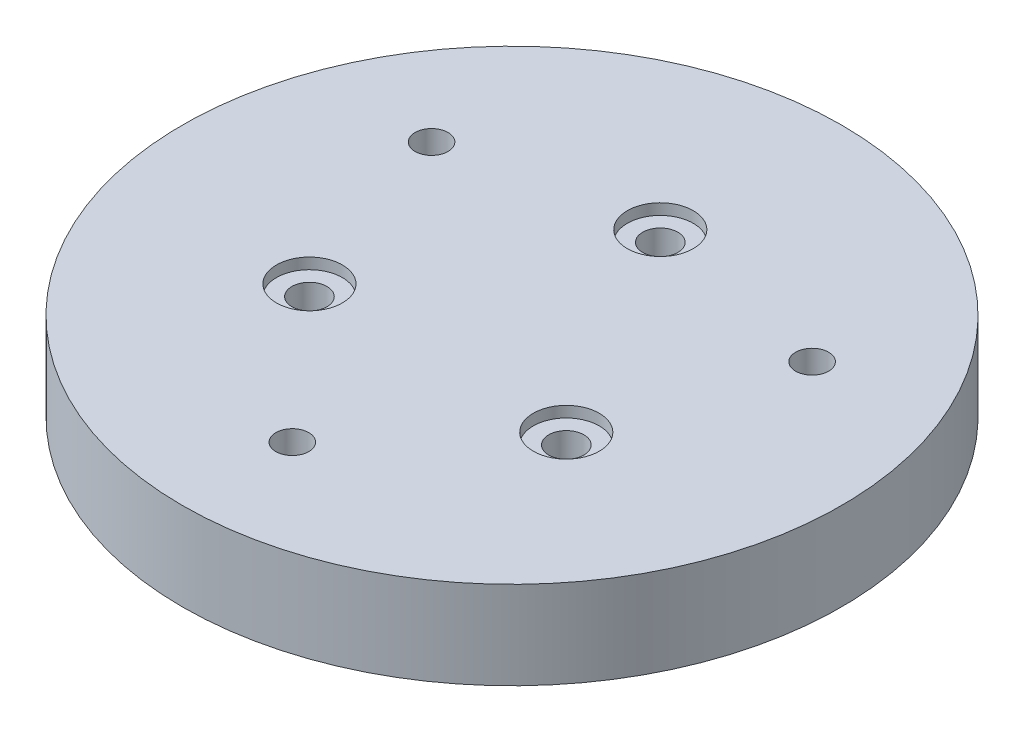
ISO-10303-21;
HEADER;
FILE_DESCRIPTION(('STEP AP214'),'2;1');
FILE_NAME('part.step','',(''),(''),'','','');
FILE_SCHEMA(('AUTOMOTIVE_DESIGN { 1 0 10303 214 1 1 1 1 }'));
ENDSEC;
DATA;
#1=APPLICATION_CONTEXT('core data for automotive mechanical design processes');
#2=APPLICATION_PROTOCOL_DEFINITION('international standard','automotive_design',2000,#1);
#3=PRODUCT_CONTEXT('',#1,'mechanical');
#4=PRODUCT('Part','Part','',(#3));
#5=PRODUCT_RELATED_PRODUCT_CATEGORY('part','',(#4));
#6=PRODUCT_DEFINITION_FORMATION('','',#4);
#7=PRODUCT_DEFINITION_CONTEXT('part definition',#1,'design');
#8=PRODUCT_DEFINITION('design','',#6,#7);
#9=PRODUCT_DEFINITION_SHAPE('','',#8);
#10=(LENGTH_UNIT() NAMED_UNIT(*) SI_UNIT(.MILLI.,.METRE.));
#11=(NAMED_UNIT(*) PLANE_ANGLE_UNIT() SI_UNIT($,.RADIAN.));
#12=(NAMED_UNIT(*) SI_UNIT($,.STERADIAN.) SOLID_ANGLE_UNIT());
#13=UNCERTAINTY_MEASURE_WITH_UNIT(LENGTH_MEASURE(1.E-05),#10,'distance_accuracy_value','');
#14=(GEOMETRIC_REPRESENTATION_CONTEXT(3) GLOBAL_UNCERTAINTY_ASSIGNED_CONTEXT((#13)) GLOBAL_UNIT_ASSIGNED_CONTEXT((#10,
#11,#12)) REPRESENTATION_CONTEXT('',''));
#15=CARTESIAN_POINT('',(0.,0.,0.));
#16=DIRECTION('',(0.,0.,1.));
#17=DIRECTION('',(1.,0.,0.));
#18=AXIS2_PLACEMENT_3D('',#15,#16,#17);
#19=CARTESIAN_POINT('',(1.32093313736707E-12,0.,19.9999999999993));
#20=DIRECTION('',(0.,1.,0.));
#21=DIRECTION('',(0.,0.,1.));
#22=AXIS2_PLACEMENT_3D('',#19,#20,#21);
#23=CYLINDRICAL_SURFACE('',#22,1.50000000000161);
#24=CARTESIAN_POINT('',(1.32093313736707E-12,8.,19.9999999999993));
#25=DIRECTION('',(0.,1.,0.));
#26=DIRECTION('',(0.,0.,1.));
#27=AXIS2_PLACEMENT_3D('',#24,#25,#26);
#28=CIRCLE('',#27,1.50000000000161);
#29=CARTESIAN_POINT('',(1.32093313736707E-12,8.,21.5000000000009));
#30=VERTEX_POINT('',#29);
#31=EDGE_CURVE('E342',#30,#30,#28,.T.);
#32=ORIENTED_EDGE('',*,*,#31,.T.);
#33=EDGE_LOOP('',(#32));
#34=FACE_BOUND('',#33,.T.);
#35=CARTESIAN_POINT('',(1.32093313736707E-12,4.,19.9999999999993));
#36=DIRECTION('',(0.,-1.,0.));
#37=DIRECTION('',(0.,0.,-1.));
#38=AXIS2_PLACEMENT_3D('',#35,#36,#37);
#39=CIRCLE('',#38,1.50000000000161);
#40=CARTESIAN_POINT('',(1.32093313736707E-12,4.,18.4999999999977));
#41=VERTEX_POINT('',#40);
#42=EDGE_CURVE('E39',#41,#41,#39,.F.);
#43=ORIENTED_EDGE('',*,*,#42,.F.);
#44=EDGE_LOOP('',(#43));
#45=FACE_BOUND('',#44,.T.);
#46=ADVANCED_FACE('F35',(#34,#45),#23,.F.);
#47=CARTESIAN_POINT('',(-17.3205080756875,0.,-9.99999999999923));
#48=DIRECTION('',(0.,1.,0.));
#49=DIRECTION('',(0.,0.,1.));
#50=AXIS2_PLACEMENT_3D('',#47,#48,#49);
#51=CYLINDRICAL_SURFACE('',#50,1.50000000000161);
#52=CARTESIAN_POINT('',(-17.3205080756875,8.,-9.99999999999923));
#53=DIRECTION('',(0.,1.,0.));
#54=DIRECTION('',(0.,0.,1.));
#55=AXIS2_PLACEMENT_3D('',#52,#53,#54);
#56=CIRCLE('',#55,1.50000000000161);
#57=CARTESIAN_POINT('',(-17.3205080756875,8.,-8.49999999999762));
#58=VERTEX_POINT('',#57);
#59=EDGE_CURVE('E339',#58,#58,#56,.T.);
#60=ORIENTED_EDGE('',*,*,#59,.T.);
#61=EDGE_LOOP('',(#60));
#62=FACE_BOUND('',#61,.T.);
#63=CARTESIAN_POINT('',(-17.3205080756875,4.,-9.99999999999923));
#64=DIRECTION('',(0.,-1.,0.));
#65=DIRECTION('',(0.,0.,-1.));
#66=AXIS2_PLACEMENT_3D('',#63,#64,#65);
#67=CIRCLE('',#66,1.50000000000161);
#68=CARTESIAN_POINT('',(-17.3205080756875,4.,-11.5000000000008));
#69=VERTEX_POINT('',#68);
#70=EDGE_CURVE('E183',#69,#69,#67,.F.);
#71=ORIENTED_EDGE('',*,*,#70,.F.);
#72=EDGE_LOOP('',(#71));
#73=FACE_BOUND('',#72,.T.);
#74=ADVANCED_FACE('F379',(#62,#73),#51,.F.);
#75=CARTESIAN_POINT('',(17.3205080756888,0.,-10.));
#76=DIRECTION('',(0.,1.,0.));
#77=DIRECTION('',(0.,0.,1.));
#78=AXIS2_PLACEMENT_3D('',#75,#76,#77);
#79=CYLINDRICAL_SURFACE('',#78,1.50000000000162);
#80=CARTESIAN_POINT('',(17.3205080756888,8.,-10.));
#81=DIRECTION('',(0.,1.,0.));
#82=DIRECTION('',(0.,0.,1.));
#83=AXIS2_PLACEMENT_3D('',#80,#81,#82);
#84=CIRCLE('',#83,1.50000000000162);
#85=CARTESIAN_POINT('',(17.3205080756888,8.,-8.49999999999841));
#86=VERTEX_POINT('',#85);
#87=EDGE_CURVE('E335',#86,#86,#84,.T.);
#88=ORIENTED_EDGE('',*,*,#87,.T.);
#89=EDGE_LOOP('',(#88));
#90=FACE_BOUND('',#89,.T.);
#91=CARTESIAN_POINT('',(17.3205080756888,4.,-10.));
#92=DIRECTION('',(0.,-1.,0.));
#93=DIRECTION('',(0.,0.,-1.));
#94=AXIS2_PLACEMENT_3D('',#91,#92,#93);
#95=CIRCLE('',#94,1.50000000000162);
#96=CARTESIAN_POINT('',(17.3205080756888,4.,-11.5000000000016));
#97=VERTEX_POINT('',#96);
#98=EDGE_CURVE('E237',#97,#97,#95,.F.);
#99=ORIENTED_EDGE('',*,*,#98,.F.);
#100=EDGE_LOOP('',(#99));
#101=FACE_BOUND('',#100,.T.);
#102=ADVANCED_FACE('F368',(#90,#101),#79,.F.);
#103=CARTESIAN_POINT('',(11.6913429510908,-7.,6.74999999999949));
#104=DIRECTION('',(0.,1.,0.));
#105=DIRECTION('',(0.,0.,1.));
#106=AXIS2_PLACEMENT_3D('',#103,#104,#105);
#107=CYLINDRICAL_SURFACE('',#106,1.60000000000075);
#108=CARTESIAN_POINT('',(11.6913429510908,0.,6.74999999999949));
#109=DIRECTION('',(0.,1.,0.));
#110=DIRECTION('',(0.,0.,1.));
#111=AXIS2_PLACEMENT_3D('',#108,#109,#110);
#112=CIRCLE('',#111,1.60000000000075);
#113=CARTESIAN_POINT('',(11.6913429510908,0.,8.35000000000024));
#114=VERTEX_POINT('',#113);
#115=EDGE_CURVE('E338',#114,#114,#112,.T.);
#116=ORIENTED_EDGE('',*,*,#115,.F.);
#117=EDGE_LOOP('',(#116));
#118=FACE_BOUND('',#117,.T.);
#119=CARTESIAN_POINT('',(11.6913429510908,7.,6.74999999999949));
#120=DIRECTION('',(0.,1.,0.));
#121=DIRECTION('',(0.,0.,1.));
#122=AXIS2_PLACEMENT_3D('',#119,#120,#121);
#123=CIRCLE('',#122,1.60000000000075);
#124=CARTESIAN_POINT('',(11.6913429510908,7.,8.35000000000024));
#125=VERTEX_POINT('',#124);
#126=EDGE_CURVE('E344',#125,#125,#123,.F.);
#127=ORIENTED_EDGE('',*,*,#126,.F.);
#128=EDGE_LOOP('',(#127));
#129=FACE_BOUND('',#128,.T.);
#130=ADVANCED_FACE('F365',(#118,#129),#107,.F.);
#131=CARTESIAN_POINT('',(-11.6913429510891,-7.,6.7500000000005));
#132=DIRECTION('',(0.,1.,0.));
#133=DIRECTION('',(0.,0.,1.));
#134=AXIS2_PLACEMENT_3D('',#131,#132,#133);
#135=CYLINDRICAL_SURFACE('',#134,1.60000000000109);
#136=CARTESIAN_POINT('',(-11.6913429510891,0.,6.7500000000005));
#137=DIRECTION('',(0.,1.,0.));
#138=DIRECTION('',(0.,0.,1.));
#139=AXIS2_PLACEMENT_3D('',#136,#137,#138);
#140=CIRCLE('',#139,1.60000000000109);
#141=CARTESIAN_POINT('',(-11.6913429510891,0.,8.35000000000159));
#142=VERTEX_POINT('',#141);
#143=EDGE_CURVE('E351',#142,#142,#140,.T.);
#144=ORIENTED_EDGE('',*,*,#143,.F.);
#145=EDGE_LOOP('',(#144));
#146=FACE_BOUND('',#145,.T.);
#147=CARTESIAN_POINT('',(-11.6913429510891,7.,6.7500000000005));
#148=DIRECTION('',(0.,1.,0.));
#149=DIRECTION('',(0.,0.,1.));
#150=AXIS2_PLACEMENT_3D('',#147,#148,#149);
#151=CIRCLE('',#150,1.60000000000109);
#152=CARTESIAN_POINT('',(-11.6913429510891,7.,8.35000000000159));
#153=VERTEX_POINT('',#152);
#154=EDGE_CURVE('E358',#153,#153,#151,.F.);
#155=ORIENTED_EDGE('',*,*,#154,.F.);
#156=EDGE_LOOP('',(#155));
#157=FACE_BOUND('',#156,.T.);
#158=ADVANCED_FACE('F367',(#146,#157),#135,.F.);
#159=CARTESIAN_POINT('',(0.,-7.,-13.5));
#160=DIRECTION('',(0.,1.,0.));
#161=DIRECTION('',(0.,0.,1.));
#162=AXIS2_PLACEMENT_3D('',#159,#160,#161);
#163=CYLINDRICAL_SURFACE('',#162,1.6);
#164=CARTESIAN_POINT('',(0.,0.,-13.5));
#165=DIRECTION('',(0.,1.,0.));
#166=DIRECTION('',(0.,0.,1.));
#167=AXIS2_PLACEMENT_3D('',#164,#165,#166);
#168=CIRCLE('',#167,1.6);
#169=CARTESIAN_POINT('',(0.,0.,-11.9));
#170=VERTEX_POINT('',#169);
#171=EDGE_CURVE('E348',#170,#170,#168,.T.);
#172=ORIENTED_EDGE('',*,*,#171,.F.);
#173=EDGE_LOOP('',(#172));
#174=FACE_BOUND('',#173,.T.);
#175=CARTESIAN_POINT('',(0.,7.,-13.5));
#176=DIRECTION('',(0.,1.,0.));
#177=DIRECTION('',(0.,0.,1.));
#178=AXIS2_PLACEMENT_3D('',#175,#176,#177);
#179=CIRCLE('',#178,1.6);
#180=CARTESIAN_POINT('',(0.,7.,-11.9));
#181=VERTEX_POINT('',#180);
#182=EDGE_CURVE('E319',#181,#181,#179,.F.);
#183=ORIENTED_EDGE('',*,*,#182,.F.);
#184=EDGE_LOOP('',(#183));
#185=FACE_BOUND('',#184,.T.);
#186=ADVANCED_FACE('F375',(#174,#185),#163,.F.);
#187=CARTESIAN_POINT('',(0.,8.,0.));
#188=DIRECTION('',(0.,-1.,0.));
#189=DIRECTION('',(0.,0.,-1.));
#190=AXIS2_PLACEMENT_3D('',#187,#188,#189);
#191=CYLINDRICAL_SURFACE('',#190,30.);
#192=CARTESIAN_POINT('',(0.,8.,0.));
#193=DIRECTION('',(0.,1.,0.));
#194=DIRECTION('',(0.,0.,1.));
#195=AXIS2_PLACEMENT_3D('',#192,#193,#194);
#196=CIRCLE('',#195,30.);
#197=CARTESIAN_POINT('',(0.,8.,30.));
#198=VERTEX_POINT('',#197);
#199=EDGE_CURVE('E11',#198,#198,#196,.T.);
#200=ORIENTED_EDGE('',*,*,#199,.F.);
#201=EDGE_LOOP('',(#200));
#202=FACE_BOUND('',#201,.T.);
#203=CARTESIAN_POINT('',(0.,0.,0.));
#204=DIRECTION('',(0.,1.,0.));
#205=DIRECTION('',(0.,0.,1.));
#206=AXIS2_PLACEMENT_3D('',#203,#204,#205);
#207=CIRCLE('',#206,30.);
#208=CARTESIAN_POINT('',(0.,0.,30.));
#209=VERTEX_POINT('',#208);
#210=EDGE_CURVE('E44',#209,#209,#207,.T.);
#211=ORIENTED_EDGE('',*,*,#210,.T.);
#212=EDGE_LOOP('',(#211));
#213=FACE_BOUND('',#212,.T.);
#214=ADVANCED_FACE('F37',(#202,#213),#191,.T.);
#215=CARTESIAN_POINT('',(0.,8.,0.));
#216=DIRECTION('',(0.,1.,0.));
#217=DIRECTION('',(0.,0.,1.));
#218=AXIS2_PLACEMENT_3D('',#215,#216,#217);
#219=PLANE('',#218);
#220=CARTESIAN_POINT('',(0.,8.,-13.5));
#221=DIRECTION('',(0.,1.,0.));
#222=DIRECTION('',(0.,0.,1.));
#223=AXIS2_PLACEMENT_3D('',#220,#221,#222);
#224=CIRCLE('',#223,3.);
#225=CARTESIAN_POINT('',(0.,8.,-10.5));
#226=VERTEX_POINT('',#225);
#227=EDGE_CURVE('E320',#226,#226,#224,.T.);
#228=ORIENTED_EDGE('',*,*,#227,.F.);
#229=EDGE_LOOP('',(#228));
#230=FACE_BOUND('',#229,.T.);
#231=CARTESIAN_POINT('',(11.6913429510908,8.,6.74999999999949));
#232=DIRECTION('',(0.,1.,0.));
#233=DIRECTION('',(0.,0.,1.));
#234=AXIS2_PLACEMENT_3D('',#231,#232,#233);
#235=CIRCLE('',#234,3.00000000000075);
#236=CARTESIAN_POINT('',(11.6913429510908,8.,9.75000000000024));
#237=VERTEX_POINT('',#236);
#238=EDGE_CURVE('E326',#237,#237,#235,.T.);
#239=ORIENTED_EDGE('',*,*,#238,.F.);
#240=EDGE_LOOP('',(#239));
#241=FACE_BOUND('',#240,.T.);
#242=CARTESIAN_POINT('',(-11.6913429510891,8.,6.7500000000005));
#243=DIRECTION('',(0.,1.,0.));
#244=DIRECTION('',(0.,0.,1.));
#245=AXIS2_PLACEMENT_3D('',#242,#243,#244);
#246=CIRCLE('',#245,3.00000000000109);
#247=CARTESIAN_POINT('',(-11.6913429510891,8.,9.75000000000159));
#248=VERTEX_POINT('',#247);
#249=EDGE_CURVE('E332',#248,#248,#246,.T.);
#250=ORIENTED_EDGE('',*,*,#249,.F.);
#251=EDGE_LOOP('',(#250));
#252=FACE_BOUND('',#251,.T.);
#253=ORIENTED_EDGE('',*,*,#87,.F.);
#254=EDGE_LOOP('',(#253));
#255=FACE_BOUND('',#254,.T.);
#256=ORIENTED_EDGE('',*,*,#59,.F.);
#257=EDGE_LOOP('',(#256));
#258=FACE_BOUND('',#257,.T.);
#259=ORIENTED_EDGE('',*,*,#31,.F.);
#260=EDGE_LOOP('',(#259));
#261=FACE_BOUND('',#260,.T.);
#262=ORIENTED_EDGE('',*,*,#199,.T.);
#263=EDGE_LOOP('',(#262));
#264=FACE_BOUND('',#263,.T.);
#265=ADVANCED_FACE('F401',(#230,#241,#252,#255,#258,#261,#264),#219,.T.);
#266=CARTESIAN_POINT('',(0.,0.,0.));
#267=DIRECTION('',(0.,1.,0.));
#268=DIRECTION('',(0.,0.,1.));
#269=AXIS2_PLACEMENT_3D('',#266,#267,#268);
#270=PLANE('',#269);
#271=DIRECTION('',(-1.,0.,0.));
#272=VECTOR('',#271,1.);
#273=CARTESIAN_POINT('',(0.,0.,-7.74999999999887));
#274=LINE('',#273,#272);
#275=CARTESIAN_POINT('',(-16.0214699700114,0.,-7.74999999999887));
#276=VERTEX_POINT('',#275);
#277=CARTESIAN_POINT('',(-18.6195461813647,0.,-7.74999999999887));
#278=VERTEX_POINT('',#277);
#279=EDGE_CURVE('E197',#276,#278,#274,.T.);
#280=ORIENTED_EDGE('',*,*,#279,.F.);
#281=DIRECTION('',(-0.5,0.,0.866025403784439));
#282=VECTOR('',#281,1.);
#283=CARTESIAN_POINT('',(-15.3719509171727,0.,-8.87499999999938));
#284=LINE('',#283,#282);
#285=CARTESIAN_POINT('',(-14.7224318643347,0.,-9.99999999999886));
#286=VERTEX_POINT('',#285);
#287=EDGE_CURVE('E52',#286,#276,#284,.T.);
#288=ORIENTED_EDGE('',*,*,#287,.F.);
#289=DIRECTION('',(0.5,0.,0.866025403784438));
#290=VECTOR('',#289,1.);
#291=CARTESIAN_POINT('',(-6.71169687932933,0.,3.87499999999996));
#292=LINE('',#291,#290);
#293=CARTESIAN_POINT('',(-16.0214699700114,0.,-12.2499999999989));
#294=VERTEX_POINT('',#293);
#295=EDGE_CURVE('E186',#294,#286,#292,.T.);
#296=ORIENTED_EDGE('',*,*,#295,.F.);
#297=DIRECTION('',(1.,0.,0.));
#298=VECTOR('',#297,1.);
#299=CARTESIAN_POINT('',(0.,0.,-12.2499999999989));
#300=LINE('',#299,#298);
#301=CARTESIAN_POINT('',(-18.6195461813647,0.,-12.2499999999989));
#302=VERTEX_POINT('',#301);
#303=EDGE_CURVE('E205',#302,#294,#300,.T.);
#304=ORIENTED_EDGE('',*,*,#303,.F.);
#305=DIRECTION('',(0.5,0.,-0.866025403784439));
#306=VECTOR('',#305,1.);
#307=CARTESIAN_POINT('',(-19.2690652342027,0.,-11.1249999999994));
#308=LINE('',#307,#306);
#309=CARTESIAN_POINT('',(-19.9185842870413,0.,-9.99999999999887));
#310=VERTEX_POINT('',#309);
#311=EDGE_CURVE('E202',#310,#302,#308,.T.);
#312=ORIENTED_EDGE('',*,*,#311,.F.);
#313=DIRECTION('',(-0.500000000000001,0.,-0.866025403784438));
#314=VECTOR('',#313,1.);
#315=CARTESIAN_POINT('',(-10.6088111963593,0.,6.12499999999996));
#316=LINE('',#315,#314);
#317=EDGE_CURVE('E199',#278,#310,#316,.T.);
#318=ORIENTED_EDGE('',*,*,#317,.F.);
#319=EDGE_LOOP('',(#280,#288,#296,#304,#312,#318));
#320=FACE_BOUND('',#319,.T.);
#321=DIRECTION('',(0.5,0.,-0.866025403784439));
#322=VECTOR('',#321,1.);
#323=CARTESIAN_POINT('',(6.71169687932884,0.,3.87499999999967));
#324=LINE('',#323,#322);
#325=CARTESIAN_POINT('',(14.7224318643349,0.,-10.0000000000003));
#326=VERTEX_POINT('',#325);
#327=CARTESIAN_POINT('',(16.0214699700115,0.,-12.2500000000003));
#328=VERTEX_POINT('',#327);
#329=EDGE_CURVE('E246',#326,#328,#324,.T.);
#330=ORIENTED_EDGE('',*,*,#329,.F.);
#331=DIRECTION('',(-0.500000000000001,0.,-0.866025403784438));
#332=VECTOR('',#331,1.);
#333=CARTESIAN_POINT('',(15.3719509171735,0.,-8.87499999999985));
#334=LINE('',#333,#332);
#335=CARTESIAN_POINT('',(16.0214699700115,0.,-7.75000000000031));
#336=VERTEX_POINT('',#335);
#337=EDGE_CURVE('E60',#336,#326,#334,.T.);
#338=ORIENTED_EDGE('',*,*,#337,.F.);
#339=DIRECTION('',(-1.,0.,0.));
#340=VECTOR('',#339,1.);
#341=CARTESIAN_POINT('',(0.,0.,-7.7500000000003));
#342=LINE('',#341,#340);
#343=CARTESIAN_POINT('',(18.6195461813648,0.,-7.75000000000031));
#344=VERTEX_POINT('',#343);
#345=EDGE_CURVE('E233',#344,#336,#342,.T.);
#346=ORIENTED_EDGE('',*,*,#345,.F.);
#347=DIRECTION('',(-0.5,0.,0.866025403784438));
#348=VECTOR('',#347,1.);
#349=CARTESIAN_POINT('',(10.6088111963588,0.,6.12499999999967));
#350=LINE('',#349,#348);
#351=CARTESIAN_POINT('',(19.9185842870415,0.,-10.0000000000003));
#352=VERTEX_POINT('',#351);
#353=EDGE_CURVE('E236',#352,#344,#350,.T.);
#354=ORIENTED_EDGE('',*,*,#353,.F.);
#355=DIRECTION('',(0.500000000000002,0.,0.866025403784438));
#356=VECTOR('',#355,1.);
#357=CARTESIAN_POINT('',(19.2690652342034,0.,-11.1249999999999));
#358=LINE('',#357,#356);
#359=CARTESIAN_POINT('',(18.6195461813648,0.,-12.2500000000003));
#360=VERTEX_POINT('',#359);
#361=EDGE_CURVE('E240',#360,#352,#358,.T.);
#362=ORIENTED_EDGE('',*,*,#361,.F.);
#363=DIRECTION('',(1.,0.,0.));
#364=VECTOR('',#363,1.);
#365=CARTESIAN_POINT('',(0.,0.,-12.2500000000003));
#366=LINE('',#365,#364);
#367=EDGE_CURVE('E243',#328,#360,#366,.T.);
#368=ORIENTED_EDGE('',*,*,#367,.F.);
#369=EDGE_LOOP('',(#330,#338,#346,#354,#362,#368));
#370=FACE_BOUND('',#369,.T.);
#371=DIRECTION('',(-1.,0.,0.));
#372=VECTOR('',#371,1.);
#373=CARTESIAN_POINT('',(1.29903810567798,0.,22.2499999999993));
#374=LINE('',#373,#372);
#375=CARTESIAN_POINT('',(1.29903810567798,0.,22.2499999999993));
#376=VERTEX_POINT('',#375);
#377=CARTESIAN_POINT('',(-1.29903810567534,0.,22.2499999999993));
#378=VERTEX_POINT('',#377);
#379=EDGE_CURVE('E296',#376,#378,#374,.T.);
#380=ORIENTED_EDGE('',*,*,#379,.F.);
#381=DIRECTION('',(-0.5,0.,0.866025403784438));
#382=VECTOR('',#381,1.);
#383=CARTESIAN_POINT('',(2.59807621135463,0.,19.9999999999993));
#384=LINE('',#383,#382);
#385=CARTESIAN_POINT('',(2.59807621135463,0.,19.9999999999993));
#386=VERTEX_POINT('',#385);
#387=EDGE_CURVE('E232',#386,#376,#384,.T.);
#388=ORIENTED_EDGE('',*,*,#387,.F.);
#389=DIRECTION('',(0.5,0.,0.866025403784439));
#390=VECTOR('',#389,1.);
#391=CARTESIAN_POINT('',(1.29903810567798,0.,17.7499999999993));
#392=LINE('',#391,#390);
#393=CARTESIAN_POINT('',(1.29903810567798,0.,17.7499999999993));
#394=VERTEX_POINT('',#393);
#395=EDGE_CURVE('E283',#394,#386,#392,.T.);
#396=ORIENTED_EDGE('',*,*,#395,.F.);
#397=DIRECTION('',(1.,0.,0.));
#398=VECTOR('',#397,1.);
#399=CARTESIAN_POINT('',(-1.29903810567534,0.,17.7499999999993));
#400=LINE('',#399,#398);
#401=CARTESIAN_POINT('',(-1.29903810567534,0.,17.7499999999993));
#402=VERTEX_POINT('',#401);
#403=EDGE_CURVE('E286',#402,#394,#400,.T.);
#404=ORIENTED_EDGE('',*,*,#403,.F.);
#405=DIRECTION('',(0.5,0.,-0.866025403784439));
#406=VECTOR('',#405,1.);
#407=CARTESIAN_POINT('',(-2.598076211352,0.,19.9999999999993));
#408=LINE('',#407,#406);
#409=CARTESIAN_POINT('',(-2.598076211352,0.,19.9999999999993));
#410=VERTEX_POINT('',#409);
#411=EDGE_CURVE('E290',#410,#402,#408,.T.);
#412=ORIENTED_EDGE('',*,*,#411,.F.);
#413=DIRECTION('',(-0.5,0.,-0.866025403784438));
#414=VECTOR('',#413,1.);
#415=CARTESIAN_POINT('',(-1.29903810567534,0.,22.2499999999993));
#416=LINE('',#415,#414);
#417=EDGE_CURVE('E293',#378,#410,#416,.T.);
#418=ORIENTED_EDGE('',*,*,#417,.F.);
#419=EDGE_LOOP('',(#380,#388,#396,#404,#412,#418));
#420=FACE_BOUND('',#419,.T.);
#421=ORIENTED_EDGE('',*,*,#171,.T.);
#422=EDGE_LOOP('',(#421));
#423=FACE_BOUND('',#422,.T.);
#424=ORIENTED_EDGE('',*,*,#143,.T.);
#425=EDGE_LOOP('',(#424));
#426=FACE_BOUND('',#425,.T.);
#427=ORIENTED_EDGE('',*,*,#115,.T.);
#428=EDGE_LOOP('',(#427));
#429=FACE_BOUND('',#428,.T.);
#430=ORIENTED_EDGE('',*,*,#210,.F.);
#431=EDGE_LOOP('',(#430));
#432=FACE_BOUND('',#431,.T.);
#433=ADVANCED_FACE('F410',(#320,#370,#420,#423,#426,#429,#432),#270,.F.);
#434=CARTESIAN_POINT('',(0.,7.,-13.5));
#435=DIRECTION('',(0.,1.,0.));
#436=DIRECTION('',(0.,0.,1.));
#437=AXIS2_PLACEMENT_3D('',#434,#435,#436);
#438=PLANE('',#437);
#439=CARTESIAN_POINT('',(0.,7.,-13.5));
#440=DIRECTION('',(0.,1.,0.));
#441=DIRECTION('',(0.,0.,1.));
#442=AXIS2_PLACEMENT_3D('',#439,#440,#441);
#443=CIRCLE('',#442,3.);
#444=CARTESIAN_POINT('',(0.,7.,-10.5));
#445=VERTEX_POINT('',#444);
#446=EDGE_CURVE('E316',#445,#445,#443,.T.);
#447=ORIENTED_EDGE('',*,*,#446,.T.);
#448=EDGE_LOOP('',(#447));
#449=FACE_BOUND('',#448,.T.);
#450=ORIENTED_EDGE('',*,*,#182,.T.);
#451=EDGE_LOOP('',(#450));
#452=FACE_BOUND('',#451,.T.);
#453=ADVANCED_FACE('F407',(#449,#452),#438,.T.);
#454=CARTESIAN_POINT('',(0.,7.,-13.5));
#455=DIRECTION('',(0.,1.,0.));
#456=DIRECTION('',(0.,0.,1.));
#457=AXIS2_PLACEMENT_3D('',#454,#455,#456);
#458=CYLINDRICAL_SURFACE('',#457,3.);
#459=ORIENTED_EDGE('',*,*,#446,.F.);
#460=EDGE_LOOP('',(#459));
#461=FACE_BOUND('',#460,.T.);
#462=ORIENTED_EDGE('',*,*,#227,.T.);
#463=EDGE_LOOP('',(#462));
#464=FACE_BOUND('',#463,.T.);
#465=ADVANCED_FACE('F409',(#461,#464),#458,.F.);
#466=CARTESIAN_POINT('',(-11.6913429510891,7.,6.7500000000005));
#467=DIRECTION('',(0.,1.,0.));
#468=DIRECTION('',(0.,0.,1.));
#469=AXIS2_PLACEMENT_3D('',#466,#467,#468);
#470=PLANE('',#469);
#471=CARTESIAN_POINT('',(-11.6913429510891,7.,6.7500000000005));
#472=DIRECTION('',(0.,1.,0.));
#473=DIRECTION('',(0.,0.,1.));
#474=AXIS2_PLACEMENT_3D('',#471,#472,#473);
#475=CIRCLE('',#474,3.00000000000109);
#476=CARTESIAN_POINT('',(-11.6913429510891,7.,9.75000000000159));
#477=VERTEX_POINT('',#476);
#478=EDGE_CURVE('E329',#477,#477,#475,.T.);
#479=ORIENTED_EDGE('',*,*,#478,.T.);
#480=EDGE_LOOP('',(#479));
#481=FACE_BOUND('',#480,.T.);
#482=ORIENTED_EDGE('',*,*,#154,.T.);
#483=EDGE_LOOP('',(#482));
#484=FACE_BOUND('',#483,.T.);
#485=ADVANCED_FACE('F417',(#481,#484),#470,.T.);
#486=CARTESIAN_POINT('',(-11.6913429510891,7.,6.7500000000005));
#487=DIRECTION('',(0.,1.,0.));
#488=DIRECTION('',(0.,0.,1.));
#489=AXIS2_PLACEMENT_3D('',#486,#487,#488);
#490=CYLINDRICAL_SURFACE('',#489,3.00000000000109);
#491=ORIENTED_EDGE('',*,*,#478,.F.);
#492=EDGE_LOOP('',(#491));
#493=FACE_BOUND('',#492,.T.);
#494=ORIENTED_EDGE('',*,*,#249,.T.);
#495=EDGE_LOOP('',(#494));
#496=FACE_BOUND('',#495,.T.);
#497=ADVANCED_FACE('F429',(#493,#496),#490,.F.);
#498=CARTESIAN_POINT('',(11.6913429510908,7.,6.74999999999949));
#499=DIRECTION('',(0.,1.,0.));
#500=DIRECTION('',(0.,0.,1.));
#501=AXIS2_PLACEMENT_3D('',#498,#499,#500);
#502=PLANE('',#501);
#503=CARTESIAN_POINT('',(11.6913429510908,7.,6.74999999999949));
#504=DIRECTION('',(0.,1.,0.));
#505=DIRECTION('',(0.,0.,1.));
#506=AXIS2_PLACEMENT_3D('',#503,#504,#505);
#507=CIRCLE('',#506,3.00000000000075);
#508=CARTESIAN_POINT('',(11.6913429510908,7.,9.75000000000024));
#509=VERTEX_POINT('',#508);
#510=EDGE_CURVE('E323',#509,#509,#507,.T.);
#511=ORIENTED_EDGE('',*,*,#510,.T.);
#512=EDGE_LOOP('',(#511));
#513=FACE_BOUND('',#512,.T.);
#514=ORIENTED_EDGE('',*,*,#126,.T.);
#515=EDGE_LOOP('',(#514));
#516=FACE_BOUND('',#515,.T.);
#517=ADVANCED_FACE('F363',(#513,#516),#502,.T.);
#518=CARTESIAN_POINT('',(11.6913429510908,7.,6.74999999999949));
#519=DIRECTION('',(0.,1.,0.));
#520=DIRECTION('',(0.,0.,1.));
#521=AXIS2_PLACEMENT_3D('',#518,#519,#520);
#522=CYLINDRICAL_SURFACE('',#521,3.00000000000075);
#523=ORIENTED_EDGE('',*,*,#510,.F.);
#524=EDGE_LOOP('',(#523));
#525=FACE_BOUND('',#524,.T.);
#526=ORIENTED_EDGE('',*,*,#238,.T.);
#527=EDGE_LOOP('',(#526));
#528=FACE_BOUND('',#527,.T.);
#529=ADVANCED_FACE('F428',(#525,#528),#522,.F.);
#530=CARTESIAN_POINT('',(15.3719509171735,4.,-8.87499999999985));
#531=DIRECTION('',(-0.866025403784438,0.,0.500000000000001));
#532=DIRECTION('',(0.500000000000001,0.,0.866025403784438));
#533=AXIS2_PLACEMENT_3D('',#530,#531,#532);
#534=PLANE('',#533);
#535=ORIENTED_EDGE('',*,*,#337,.T.);
#536=DIRECTION('',(0.,-1.,0.));
#537=VECTOR('',#536,1.);
#538=CARTESIAN_POINT('',(14.7224318643349,4.,-10.0000000000003));
#539=LINE('',#538,#537);
#540=CARTESIAN_POINT('',(14.7224318643349,4.,-10.0000000000003));
#541=VERTEX_POINT('',#540);
#542=EDGE_CURVE('E219',#541,#326,#539,.T.);
#543=ORIENTED_EDGE('',*,*,#542,.F.);
#544=DIRECTION('',(-0.500000000000001,0.,-0.866025403784438));
#545=VECTOR('',#544,1.);
#546=CARTESIAN_POINT('',(15.3719509171735,4.,-8.87499999999985));
#547=LINE('',#546,#545);
#548=CARTESIAN_POINT('',(16.0214699700115,4.,-7.75000000000031));
#549=VERTEX_POINT('',#548);
#550=EDGE_CURVE('E264',#549,#541,#547,.T.);
#551=ORIENTED_EDGE('',*,*,#550,.F.);
#552=DIRECTION('',(0.,-1.,0.));
#553=VECTOR('',#552,1.);
#554=CARTESIAN_POINT('',(16.0214699700115,4.,-7.75000000000031));
#555=LINE('',#554,#553);
#556=EDGE_CURVE('E230',#549,#336,#555,.T.);
#557=ORIENTED_EDGE('',*,*,#556,.T.);
#558=EDGE_LOOP('',(#535,#543,#551,#557));
#559=FACE_BOUND('',#558,.T.);
#560=ADVANCED_FACE('F433',(#559),#534,.F.);
#561=CARTESIAN_POINT('',(0.,4.,-7.7500000000003));
#562=DIRECTION('',(0.,0.,1.));
#563=DIRECTION('',(1.,0.,0.));
#564=AXIS2_PLACEMENT_3D('',#561,#562,#563);
#565=PLANE('',#564);
#566=ORIENTED_EDGE('',*,*,#345,.T.);
#567=ORIENTED_EDGE('',*,*,#556,.F.);
#568=DIRECTION('',(-1.,0.,0.));
#569=VECTOR('',#568,1.);
#570=CARTESIAN_POINT('',(0.,4.,-7.7500000000003));
#571=LINE('',#570,#569);
#572=CARTESIAN_POINT('',(18.6195461813648,4.,-7.75000000000031));
#573=VERTEX_POINT('',#572);
#574=EDGE_CURVE('E221',#573,#549,#571,.T.);
#575=ORIENTED_EDGE('',*,*,#574,.F.);
#576=DIRECTION('',(0.,-1.,0.));
#577=VECTOR('',#576,1.);
#578=CARTESIAN_POINT('',(18.6195461813648,4.,-7.75000000000031));
#579=LINE('',#578,#577);
#580=EDGE_CURVE('E228',#573,#344,#579,.T.);
#581=ORIENTED_EDGE('',*,*,#580,.T.);
#582=EDGE_LOOP('',(#566,#567,#575,#581));
#583=FACE_BOUND('',#582,.T.);
#584=ADVANCED_FACE('F492',(#583),#565,.F.);
#585=CARTESIAN_POINT('',(10.6088111963588,4.,6.12499999999967));
#586=DIRECTION('',(0.866025403784438,0.,0.5));
#587=DIRECTION('',(0.5,0.,-0.866025403784438));
#588=AXIS2_PLACEMENT_3D('',#585,#586,#587);
#589=PLANE('',#588);
#590=ORIENTED_EDGE('',*,*,#353,.T.);
#591=ORIENTED_EDGE('',*,*,#580,.F.);
#592=DIRECTION('',(-0.5,0.,0.866025403784438));
#593=VECTOR('',#592,1.);
#594=CARTESIAN_POINT('',(10.6088111963588,4.,6.12499999999967));
#595=LINE('',#594,#593);
#596=CARTESIAN_POINT('',(19.9185842870415,4.,-10.0000000000003));
#597=VERTEX_POINT('',#596);
#598=EDGE_CURVE('E252',#597,#573,#595,.T.);
#599=ORIENTED_EDGE('',*,*,#598,.F.);
#600=DIRECTION('',(0.,-1.,0.));
#601=VECTOR('',#600,1.);
#602=CARTESIAN_POINT('',(19.9185842870415,4.,-10.0000000000003));
#603=LINE('',#602,#601);
#604=EDGE_CURVE('E226',#597,#352,#603,.T.);
#605=ORIENTED_EDGE('',*,*,#604,.T.);
#606=EDGE_LOOP('',(#590,#591,#599,#605));
#607=FACE_BOUND('',#606,.T.);
#608=ADVANCED_FACE('F504',(#607),#589,.F.);
#609=CARTESIAN_POINT('',(19.2690652342034,4.,-11.1249999999999));
#610=DIRECTION('',(0.866025403784438,0.,-0.500000000000002));
#611=DIRECTION('',(-0.500000000000002,0.,-0.866025403784438));
#612=AXIS2_PLACEMENT_3D('',#609,#610,#611);
#613=PLANE('',#612);
#614=ORIENTED_EDGE('',*,*,#361,.T.);
#615=ORIENTED_EDGE('',*,*,#604,.F.);
#616=DIRECTION('',(0.500000000000002,0.,0.866025403784438));
#617=VECTOR('',#616,1.);
#618=CARTESIAN_POINT('',(19.2690652342034,4.,-11.1249999999999));
#619=LINE('',#618,#617);
#620=CARTESIAN_POINT('',(18.6195461813648,4.,-12.2500000000003));
#621=VERTEX_POINT('',#620);
#622=EDGE_CURVE('E255',#621,#597,#619,.T.);
#623=ORIENTED_EDGE('',*,*,#622,.F.);
#624=DIRECTION('',(0.,-1.,0.));
#625=VECTOR('',#624,1.);
#626=CARTESIAN_POINT('',(18.6195461813648,4.,-12.2500000000003));
#627=LINE('',#626,#625);
#628=EDGE_CURVE('E224',#621,#360,#627,.T.);
#629=ORIENTED_EDGE('',*,*,#628,.T.);
#630=EDGE_LOOP('',(#614,#615,#623,#629));
#631=FACE_BOUND('',#630,.T.);
#632=ADVANCED_FACE('F500',(#631),#613,.F.);
#633=CARTESIAN_POINT('',(0.,4.,-12.2500000000003));
#634=DIRECTION('',(0.,0.,-1.));
#635=DIRECTION('',(-1.,0.,0.));
#636=AXIS2_PLACEMENT_3D('',#633,#634,#635);
#637=PLANE('',#636);
#638=ORIENTED_EDGE('',*,*,#367,.T.);
#639=ORIENTED_EDGE('',*,*,#628,.F.);
#640=DIRECTION('',(1.,0.,0.));
#641=VECTOR('',#640,1.);
#642=CARTESIAN_POINT('',(0.,4.,-12.2500000000003));
#643=LINE('',#642,#641);
#644=CARTESIAN_POINT('',(16.0214699700115,4.,-12.2500000000003));
#645=VERTEX_POINT('',#644);
#646=EDGE_CURVE('E258',#645,#621,#643,.T.);
#647=ORIENTED_EDGE('',*,*,#646,.F.);
#648=DIRECTION('',(0.,-1.,0.));
#649=VECTOR('',#648,1.);
#650=CARTESIAN_POINT('',(16.0214699700115,4.,-12.2500000000003));
#651=LINE('',#650,#649);
#652=EDGE_CURVE('E222',#645,#328,#651,.T.);
#653=ORIENTED_EDGE('',*,*,#652,.T.);
#654=EDGE_LOOP('',(#638,#639,#647,#653));
#655=FACE_BOUND('',#654,.T.);
#656=ADVANCED_FACE('F496',(#655),#637,.F.);
#657=CARTESIAN_POINT('',(6.71169687932884,4.,3.87499999999967));
#658=DIRECTION('',(-0.866025403784439,0.,-0.499999999999999));
#659=DIRECTION('',(-0.5,0.,0.866025403784439));
#660=AXIS2_PLACEMENT_3D('',#657,#658,#659);
#661=PLANE('',#660);
#662=ORIENTED_EDGE('',*,*,#329,.T.);
#663=ORIENTED_EDGE('',*,*,#652,.F.);
#664=DIRECTION('',(0.5,0.,-0.866025403784439));
#665=VECTOR('',#664,1.);
#666=CARTESIAN_POINT('',(6.71169687932884,4.,3.87499999999967));
#667=LINE('',#666,#665);
#668=EDGE_CURVE('E261',#541,#645,#667,.T.);
#669=ORIENTED_EDGE('',*,*,#668,.F.);
#670=ORIENTED_EDGE('',*,*,#542,.T.);
#671=EDGE_LOOP('',(#662,#663,#669,#670));
#672=FACE_BOUND('',#671,.T.);
#673=ADVANCED_FACE('F493',(#672),#661,.F.);
#674=CARTESIAN_POINT('',(0.,4.,0.));
#675=DIRECTION('',(0.,-1.,0.));
#676=DIRECTION('',(0.,0.,-1.));
#677=AXIS2_PLACEMENT_3D('',#674,#675,#676);
#678=PLANE('',#677);
#679=ORIENTED_EDGE('',*,*,#98,.T.);
#680=EDGE_LOOP('',(#679));
#681=FACE_BOUND('',#680,.T.);
#682=ORIENTED_EDGE('',*,*,#550,.T.);
#683=ORIENTED_EDGE('',*,*,#668,.T.);
#684=ORIENTED_EDGE('',*,*,#646,.T.);
#685=ORIENTED_EDGE('',*,*,#622,.T.);
#686=ORIENTED_EDGE('',*,*,#598,.T.);
#687=ORIENTED_EDGE('',*,*,#574,.T.);
#688=EDGE_LOOP('',(#682,#683,#684,#685,#686,#687));
#689=FACE_BOUND('',#688,.T.);
#690=ADVANCED_FACE('F489',(#681,#689),#678,.T.);
#691=CARTESIAN_POINT('',(-15.3719509171727,4.,-8.87499999999938));
#692=DIRECTION('',(0.866025403784439,0.,0.499999999999999));
#693=DIRECTION('',(0.5,0.,-0.866025403784439));
#694=AXIS2_PLACEMENT_3D('',#691,#692,#693);
#695=PLANE('',#694);
#696=ORIENTED_EDGE('',*,*,#287,.T.);
#697=DIRECTION('',(0.,-1.,0.));
#698=VECTOR('',#697,1.);
#699=CARTESIAN_POINT('',(-16.0214699700114,4.,-7.74999999999887));
#700=LINE('',#699,#698);
#701=CARTESIAN_POINT('',(-16.0214699700114,4.,-7.74999999999887));
#702=VERTEX_POINT('',#701);
#703=EDGE_CURVE('E160',#702,#276,#700,.T.);
#704=ORIENTED_EDGE('',*,*,#703,.F.);
#705=DIRECTION('',(-0.5,0.,0.866025403784439));
#706=VECTOR('',#705,1.);
#707=CARTESIAN_POINT('',(-15.3719509171727,4.,-8.87499999999938));
#708=LINE('',#707,#706);
#709=CARTESIAN_POINT('',(-14.7224318643347,4.,-9.99999999999886));
#710=VERTEX_POINT('',#709);
#711=EDGE_CURVE('E164',#710,#702,#708,.T.);
#712=ORIENTED_EDGE('',*,*,#711,.F.);
#713=DIRECTION('',(0.,-1.,0.));
#714=VECTOR('',#713,1.);
#715=CARTESIAN_POINT('',(-14.7224318643347,4.,-9.99999999999886));
#716=LINE('',#715,#714);
#717=EDGE_CURVE('E210',#710,#286,#716,.T.);
#718=ORIENTED_EDGE('',*,*,#717,.T.);
#719=EDGE_LOOP('',(#696,#704,#712,#718));
#720=FACE_BOUND('',#719,.T.);
#721=ADVANCED_FACE('F162',(#720),#695,.F.);
#722=CARTESIAN_POINT('',(-6.71169687932933,4.,3.87499999999996));
#723=DIRECTION('',(0.866025403784438,0.,-0.5));
#724=DIRECTION('',(-0.5,0.,-0.866025403784438));
#725=AXIS2_PLACEMENT_3D('',#722,#723,#724);
#726=PLANE('',#725);
#727=ORIENTED_EDGE('',*,*,#295,.T.);
#728=ORIENTED_EDGE('',*,*,#717,.F.);
#729=DIRECTION('',(0.5,0.,0.866025403784438));
#730=VECTOR('',#729,1.);
#731=CARTESIAN_POINT('',(-6.71169687932933,4.,3.87499999999996));
#732=LINE('',#731,#730);
#733=CARTESIAN_POINT('',(-16.0214699700114,4.,-12.2499999999989));
#734=VERTEX_POINT('',#733);
#735=EDGE_CURVE('E170',#734,#710,#732,.T.);
#736=ORIENTED_EDGE('',*,*,#735,.F.);
#737=DIRECTION('',(0.,-1.,0.));
#738=VECTOR('',#737,1.);
#739=CARTESIAN_POINT('',(-16.0214699700114,4.,-12.2499999999989));
#740=LINE('',#739,#738);
#741=EDGE_CURVE('E212',#734,#294,#740,.T.);
#742=ORIENTED_EDGE('',*,*,#741,.T.);
#743=EDGE_LOOP('',(#727,#728,#736,#742));
#744=FACE_BOUND('',#743,.T.);
#745=ADVANCED_FACE('F472',(#744),#726,.F.);
#746=CARTESIAN_POINT('',(0.,4.,-12.2499999999989));
#747=DIRECTION('',(0.,0.,-1.));
#748=DIRECTION('',(-1.,0.,0.));
#749=AXIS2_PLACEMENT_3D('',#746,#747,#748);
#750=PLANE('',#749);
#751=ORIENTED_EDGE('',*,*,#303,.T.);
#752=ORIENTED_EDGE('',*,*,#741,.F.);
#753=DIRECTION('',(1.,0.,0.));
#754=VECTOR('',#753,1.);
#755=CARTESIAN_POINT('',(0.,4.,-12.2499999999989));
#756=LINE('',#755,#754);
#757=CARTESIAN_POINT('',(-18.6195461813647,4.,-12.2499999999989));
#758=VERTEX_POINT('',#757);
#759=EDGE_CURVE('E193',#758,#734,#756,.T.);
#760=ORIENTED_EDGE('',*,*,#759,.F.);
#761=DIRECTION('',(0.,-1.,0.));
#762=VECTOR('',#761,1.);
#763=CARTESIAN_POINT('',(-18.6195461813647,4.,-12.2499999999989));
#764=LINE('',#763,#762);
#765=EDGE_CURVE('E214',#758,#302,#764,.T.);
#766=ORIENTED_EDGE('',*,*,#765,.T.);
#767=EDGE_LOOP('',(#751,#752,#760,#766));
#768=FACE_BOUND('',#767,.T.);
#769=ADVANCED_FACE('F475',(#768),#750,.F.);
#770=CARTESIAN_POINT('',(-19.2690652342027,4.,-11.1249999999994));
#771=DIRECTION('',(-0.866025403784439,0.,-0.5));
#772=DIRECTION('',(-0.5,0.,0.866025403784439));
#773=AXIS2_PLACEMENT_3D('',#770,#771,#772);
#774=PLANE('',#773);
#775=ORIENTED_EDGE('',*,*,#311,.T.);
#776=ORIENTED_EDGE('',*,*,#765,.F.);
#777=DIRECTION('',(0.5,0.,-0.866025403784439));
#778=VECTOR('',#777,1.);
#779=CARTESIAN_POINT('',(-19.2690652342027,4.,-11.1249999999994));
#780=LINE('',#779,#778);
#781=CARTESIAN_POINT('',(-19.9185842870413,4.,-9.99999999999887));
#782=VERTEX_POINT('',#781);
#783=EDGE_CURVE('E190',#782,#758,#780,.T.);
#784=ORIENTED_EDGE('',*,*,#783,.F.);
#785=DIRECTION('',(0.,-1.,0.));
#786=VECTOR('',#785,1.);
#787=CARTESIAN_POINT('',(-19.9185842870413,4.,-9.99999999999887));
#788=LINE('',#787,#786);
#789=EDGE_CURVE('E216',#782,#310,#788,.T.);
#790=ORIENTED_EDGE('',*,*,#789,.T.);
#791=EDGE_LOOP('',(#775,#776,#784,#790));
#792=FACE_BOUND('',#791,.T.);
#793=ADVANCED_FACE('F479',(#792),#774,.F.);
#794=CARTESIAN_POINT('',(-10.6088111963593,4.,6.12499999999996));
#795=DIRECTION('',(-0.866025403784438,0.,0.500000000000001));
#796=DIRECTION('',(0.500000000000001,0.,0.866025403784438));
#797=AXIS2_PLACEMENT_3D('',#794,#795,#796);
#798=PLANE('',#797);
#799=ORIENTED_EDGE('',*,*,#317,.T.);
#800=ORIENTED_EDGE('',*,*,#789,.F.);
#801=DIRECTION('',(-0.500000000000001,0.,-0.866025403784438));
#802=VECTOR('',#801,1.);
#803=CARTESIAN_POINT('',(-10.6088111963593,4.,6.12499999999996));
#804=LINE('',#803,#802);
#805=CARTESIAN_POINT('',(-18.6195461813647,4.,-7.74999999999887));
#806=VERTEX_POINT('',#805);
#807=EDGE_CURVE('E178',#806,#782,#804,.T.);
#808=ORIENTED_EDGE('',*,*,#807,.F.);
#809=DIRECTION('',(0.,-1.,0.));
#810=VECTOR('',#809,1.);
#811=CARTESIAN_POINT('',(-18.6195461813647,4.,-7.74999999999887));
#812=LINE('',#811,#810);
#813=EDGE_CURVE('E169',#806,#278,#812,.T.);
#814=ORIENTED_EDGE('',*,*,#813,.T.);
#815=EDGE_LOOP('',(#799,#800,#808,#814));
#816=FACE_BOUND('',#815,.T.);
#817=ADVANCED_FACE('F469',(#816),#798,.F.);
#818=CARTESIAN_POINT('',(0.,4.,-7.74999999999887));
#819=DIRECTION('',(0.,0.,1.));
#820=DIRECTION('',(1.,0.,0.));
#821=AXIS2_PLACEMENT_3D('',#818,#819,#820);
#822=PLANE('',#821);
#823=ORIENTED_EDGE('',*,*,#279,.T.);
#824=ORIENTED_EDGE('',*,*,#813,.F.);
#825=DIRECTION('',(-1.,0.,0.));
#826=VECTOR('',#825,1.);
#827=CARTESIAN_POINT('',(0.,4.,-7.74999999999887));
#828=LINE('',#827,#826);
#829=EDGE_CURVE('E173',#702,#806,#828,.T.);
#830=ORIENTED_EDGE('',*,*,#829,.F.);
#831=ORIENTED_EDGE('',*,*,#703,.T.);
#832=EDGE_LOOP('',(#823,#824,#830,#831));
#833=FACE_BOUND('',#832,.T.);
#834=ADVANCED_FACE('F174',(#833),#822,.F.);
#835=CARTESIAN_POINT('',(0.,4.,0.));
#836=DIRECTION('',(0.,-1.,0.));
#837=DIRECTION('',(0.,0.,-1.));
#838=AXIS2_PLACEMENT_3D('',#835,#836,#837);
#839=PLANE('',#838);
#840=ORIENTED_EDGE('',*,*,#70,.T.);
#841=EDGE_LOOP('',(#840));
#842=FACE_BOUND('',#841,.T.);
#843=ORIENTED_EDGE('',*,*,#711,.T.);
#844=ORIENTED_EDGE('',*,*,#829,.T.);
#845=ORIENTED_EDGE('',*,*,#807,.T.);
#846=ORIENTED_EDGE('',*,*,#783,.T.);
#847=ORIENTED_EDGE('',*,*,#759,.T.);
#848=ORIENTED_EDGE('',*,*,#735,.T.);
#849=EDGE_LOOP('',(#843,#844,#845,#846,#847,#848));
#850=FACE_BOUND('',#849,.T.);
#851=ADVANCED_FACE('F180',(#842,#850),#839,.T.);
#852=CARTESIAN_POINT('',(0.,4.,0.));
#853=DIRECTION('',(0.,-1.,0.));
#854=DIRECTION('',(0.,0.,-1.));
#855=AXIS2_PLACEMENT_3D('',#852,#853,#854);
#856=PLANE('',#855);
#857=DIRECTION('',(-0.5,0.,0.866025403784438));
#858=VECTOR('',#857,1.);
#859=CARTESIAN_POINT('',(2.59807621135463,4.,19.9999999999993));
#860=LINE('',#859,#858);
#861=CARTESIAN_POINT('',(2.59807621135463,4.,19.9999999999993));
#862=VERTEX_POINT('',#861);
#863=CARTESIAN_POINT('',(1.29903810567798,4.,22.2499999999993));
#864=VERTEX_POINT('',#863);
#865=EDGE_CURVE('E287',#862,#864,#860,.T.);
#866=ORIENTED_EDGE('',*,*,#865,.T.);
#867=DIRECTION('',(-1.,0.,0.));
#868=VECTOR('',#867,1.);
#869=CARTESIAN_POINT('',(1.29903810567798,4.,22.2499999999993));
#870=LINE('',#869,#868);
#871=CARTESIAN_POINT('',(-1.29903810567534,4.,22.2499999999993));
#872=VERTEX_POINT('',#871);
#873=EDGE_CURVE('E311',#864,#872,#870,.T.);
#874=ORIENTED_EDGE('',*,*,#873,.T.);
#875=DIRECTION('',(-0.5,0.,-0.866025403784438));
#876=VECTOR('',#875,1.);
#877=CARTESIAN_POINT('',(-1.29903810567534,4.,22.2499999999993));
#878=LINE('',#877,#876);
#879=CARTESIAN_POINT('',(-2.598076211352,4.,19.9999999999993));
#880=VERTEX_POINT('',#879);
#881=EDGE_CURVE('E308',#872,#880,#878,.T.);
#882=ORIENTED_EDGE('',*,*,#881,.T.);
#883=DIRECTION('',(0.5,0.,-0.866025403784439));
#884=VECTOR('',#883,1.);
#885=CARTESIAN_POINT('',(-2.598076211352,4.,19.9999999999993));
#886=LINE('',#885,#884);
#887=CARTESIAN_POINT('',(-1.29903810567534,4.,17.7499999999993));
#888=VERTEX_POINT('',#887);
#889=EDGE_CURVE('E305',#880,#888,#886,.T.);
#890=ORIENTED_EDGE('',*,*,#889,.T.);
#891=DIRECTION('',(1.,0.,0.));
#892=VECTOR('',#891,1.);
#893=CARTESIAN_POINT('',(-1.29903810567534,4.,17.7499999999993));
#894=LINE('',#893,#892);
#895=CARTESIAN_POINT('',(1.29903810567798,4.,17.7499999999993));
#896=VERTEX_POINT('',#895);
#897=EDGE_CURVE('E302',#888,#896,#894,.T.);
#898=ORIENTED_EDGE('',*,*,#897,.T.);
#899=DIRECTION('',(0.5,0.,0.866025403784439));
#900=VECTOR('',#899,1.);
#901=CARTESIAN_POINT('',(1.29903810567798,4.,17.7499999999993));
#902=LINE('',#901,#900);
#903=EDGE_CURVE('E272',#896,#862,#902,.T.);
#904=ORIENTED_EDGE('',*,*,#903,.T.);
#905=EDGE_LOOP('',(#866,#874,#882,#890,#898,#904));
#906=FACE_BOUND('',#905,.T.);
#907=ORIENTED_EDGE('',*,*,#42,.T.);
#908=EDGE_LOOP('',(#907));
#909=FACE_BOUND('',#908,.T.);
#910=ADVANCED_FACE('F423',(#906,#909),#856,.T.);
#911=CARTESIAN_POINT('',(2.59807621135463,4.,19.9999999999993));
#912=DIRECTION('',(0.866025403784439,0.,0.5));
#913=DIRECTION('',(0.5,0.,-0.866025403784438));
#914=AXIS2_PLACEMENT_3D('',#911,#912,#913);
#915=PLANE('',#914);
#916=ORIENTED_EDGE('',*,*,#387,.T.);
#917=DIRECTION('',(0.,-1.,0.));
#918=VECTOR('',#917,1.);
#919=CARTESIAN_POINT('',(1.29903810567798,4.,22.2499999999993));
#920=LINE('',#919,#918);
#921=EDGE_CURVE('E269',#864,#376,#920,.T.);
#922=ORIENTED_EDGE('',*,*,#921,.F.);
#923=ORIENTED_EDGE('',*,*,#865,.F.);
#924=DIRECTION('',(0.,-1.,0.));
#925=VECTOR('',#924,1.);
#926=CARTESIAN_POINT('',(2.59807621135463,4.,19.9999999999993));
#927=LINE('',#926,#925);
#928=EDGE_CURVE('E281',#862,#386,#927,.T.);
#929=ORIENTED_EDGE('',*,*,#928,.T.);
#930=EDGE_LOOP('',(#916,#922,#923,#929));
#931=FACE_BOUND('',#930,.T.);
#932=ADVANCED_FACE('F467',(#931),#915,.F.);
#933=CARTESIAN_POINT('',(1.29903810567798,4.,17.7499999999993));
#934=DIRECTION('',(0.866025403784439,0.,-0.5));
#935=DIRECTION('',(-0.5,0.,-0.866025403784439));
#936=AXIS2_PLACEMENT_3D('',#933,#934,#935);
#937=PLANE('',#936);
#938=ORIENTED_EDGE('',*,*,#395,.T.);
#939=ORIENTED_EDGE('',*,*,#928,.F.);
#940=ORIENTED_EDGE('',*,*,#903,.F.);
#941=DIRECTION('',(0.,-1.,0.));
#942=VECTOR('',#941,1.);
#943=CARTESIAN_POINT('',(1.29903810567798,4.,17.7499999999993));
#944=LINE('',#943,#942);
#945=EDGE_CURVE('E279',#896,#394,#944,.T.);
#946=ORIENTED_EDGE('',*,*,#945,.T.);
#947=EDGE_LOOP('',(#938,#939,#940,#946));
#948=FACE_BOUND('',#947,.T.);
#949=ADVANCED_FACE('F517',(#948),#937,.F.);
#950=CARTESIAN_POINT('',(-1.29903810567534,4.,17.7499999999993));
#951=DIRECTION('',(0.,0.,-1.));
#952=DIRECTION('',(-1.,0.,0.));
#953=AXIS2_PLACEMENT_3D('',#950,#951,#952);
#954=PLANE('',#953);
#955=ORIENTED_EDGE('',*,*,#403,.T.);
#956=ORIENTED_EDGE('',*,*,#945,.F.);
#957=ORIENTED_EDGE('',*,*,#897,.F.);
#958=DIRECTION('',(0.,-1.,0.));
#959=VECTOR('',#958,1.);
#960=CARTESIAN_POINT('',(-1.29903810567534,4.,17.7499999999993));
#961=LINE('',#960,#959);
#962=EDGE_CURVE('E277',#888,#402,#961,.T.);
#963=ORIENTED_EDGE('',*,*,#962,.T.);
#964=EDGE_LOOP('',(#955,#956,#957,#963));
#965=FACE_BOUND('',#964,.T.);
#966=ADVANCED_FACE('F530',(#965),#954,.F.);
#967=CARTESIAN_POINT('',(-2.598076211352,4.,19.9999999999993));
#968=DIRECTION('',(-0.866025403784439,0.,-0.5));
#969=DIRECTION('',(-0.5,0.,0.866025403784439));
#970=AXIS2_PLACEMENT_3D('',#967,#968,#969);
#971=PLANE('',#970);
#972=ORIENTED_EDGE('',*,*,#411,.T.);
#973=ORIENTED_EDGE('',*,*,#962,.F.);
#974=ORIENTED_EDGE('',*,*,#889,.F.);
#975=DIRECTION('',(0.,-1.,0.));
#976=VECTOR('',#975,1.);
#977=CARTESIAN_POINT('',(-2.598076211352,4.,19.9999999999993));
#978=LINE('',#977,#976);
#979=EDGE_CURVE('E275',#880,#410,#978,.T.);
#980=ORIENTED_EDGE('',*,*,#979,.T.);
#981=EDGE_LOOP('',(#972,#973,#974,#980));
#982=FACE_BOUND('',#981,.T.);
#983=ADVANCED_FACE('F526',(#982),#971,.F.);
#984=CARTESIAN_POINT('',(-1.29903810567534,4.,22.2499999999993));
#985=DIRECTION('',(-0.866025403784438,0.,0.5));
#986=DIRECTION('',(0.5,0.,0.866025403784439));
#987=AXIS2_PLACEMENT_3D('',#984,#985,#986);
#988=PLANE('',#987);
#989=ORIENTED_EDGE('',*,*,#417,.T.);
#990=ORIENTED_EDGE('',*,*,#979,.F.);
#991=ORIENTED_EDGE('',*,*,#881,.F.);
#992=DIRECTION('',(0.,-1.,0.));
#993=VECTOR('',#992,1.);
#994=CARTESIAN_POINT('',(-1.29903810567534,4.,22.2499999999993));
#995=LINE('',#994,#993);
#996=EDGE_CURVE('E273',#872,#378,#995,.T.);
#997=ORIENTED_EDGE('',*,*,#996,.T.);
#998=EDGE_LOOP('',(#989,#990,#991,#997));
#999=FACE_BOUND('',#998,.T.);
#1000=ADVANCED_FACE('F522',(#999),#988,.F.);
#1001=CARTESIAN_POINT('',(1.29903810567798,4.,22.2499999999993));
#1002=DIRECTION('',(0.,0.,1.));
#1003=DIRECTION('',(1.,0.,0.));
#1004=AXIS2_PLACEMENT_3D('',#1001,#1002,#1003);
#1005=PLANE('',#1004);
#1006=ORIENTED_EDGE('',*,*,#379,.T.);
#1007=ORIENTED_EDGE('',*,*,#996,.F.);
#1008=ORIENTED_EDGE('',*,*,#873,.F.);
#1009=ORIENTED_EDGE('',*,*,#921,.T.);
#1010=EDGE_LOOP('',(#1006,#1007,#1008,#1009));
#1011=FACE_BOUND('',#1010,.T.);
#1012=ADVANCED_FACE('F519',(#1011),#1005,.F.);
#1013=CLOSED_SHELL('',(#46,#74,#102,#130,#158,#186,#214,#265,#433,#453,#465,#485,#497,#517,#529,
#560,#584,#608,#632,#656,#673,#690,#721,#745,#769,#793,#817,#834,#851,#910,#932,#949,#966,#983,
#1000,#1012));
#1014=MANIFOLD_SOLID_BREP('B2',#1013);
#1015=ADVANCED_BREP_SHAPE_REPRESENTATION('',(#18,#1014),#14);
#1016=SHAPE_DEFINITION_REPRESENTATION(#9,#1015);
ENDSEC;
END-ISO-10303-21;
